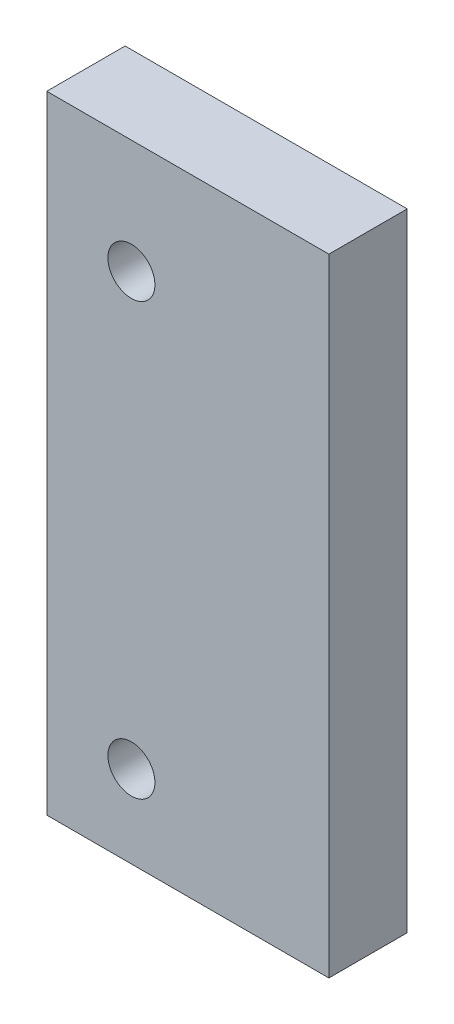
ISO-10303-21;
HEADER;
FILE_DESCRIPTION(('STEP AP214'),'2;1');
FILE_NAME('part.step','',(''),(''),'','','');
FILE_SCHEMA(('AUTOMOTIVE_DESIGN { 1 0 10303 214 1 1 1 1 }'));
ENDSEC;
DATA;
#1=APPLICATION_CONTEXT('core data for automotive mechanical design processes');
#2=APPLICATION_PROTOCOL_DEFINITION('international standard','automotive_design',2000,#1);
#3=PRODUCT_CONTEXT('',#1,'mechanical');
#4=PRODUCT('Part','Part','',(#3));
#5=PRODUCT_RELATED_PRODUCT_CATEGORY('part','',(#4));
#6=PRODUCT_DEFINITION_FORMATION('','',#4);
#7=PRODUCT_DEFINITION_CONTEXT('part definition',#1,'design');
#8=PRODUCT_DEFINITION('design','',#6,#7);
#9=PRODUCT_DEFINITION_SHAPE('','',#8);
#10=(LENGTH_UNIT() NAMED_UNIT(*) SI_UNIT(.MILLI.,.METRE.));
#11=(NAMED_UNIT(*) PLANE_ANGLE_UNIT() SI_UNIT($,.RADIAN.));
#12=(NAMED_UNIT(*) SI_UNIT($,.STERADIAN.) SOLID_ANGLE_UNIT());
#13=UNCERTAINTY_MEASURE_WITH_UNIT(LENGTH_MEASURE(1.E-05),#10,'distance_accuracy_value','');
#14=(GEOMETRIC_REPRESENTATION_CONTEXT(3) GLOBAL_UNCERTAINTY_ASSIGNED_CONTEXT((#13)) GLOBAL_UNIT_ASSIGNED_CONTEXT((#10,
#11,#12)) REPRESENTATION_CONTEXT('',''));
#15=CARTESIAN_POINT('',(0.,0.,0.));
#16=DIRECTION('',(0.,0.,1.));
#17=DIRECTION('',(1.,0.,0.));
#18=AXIS2_PLACEMENT_3D('',#15,#16,#17);
#19=CARTESIAN_POINT('',(9.,0.,2.5));
#20=DIRECTION('',(0.,1.,0.));
#21=DIRECTION('',(0.,0.,1.));
#22=AXIS2_PLACEMENT_3D('',#19,#20,#21);
#23=PLANE('',#22);
#24=DIRECTION('',(1.,0.,0.));
#25=VECTOR('',#24,1.);
#26=CARTESIAN_POINT('',(9.,0.,0.));
#27=LINE('',#26,#25);
#28=CARTESIAN_POINT('',(0.,0.,0.));
#29=VERTEX_POINT('',#28);
#30=CARTESIAN_POINT('',(9.,0.,0.));
#31=VERTEX_POINT('',#30);
#32=EDGE_CURVE('E96',#29,#31,#27,.T.);
#33=ORIENTED_EDGE('',*,*,#32,.T.);
#34=DIRECTION('',(0.,0.,-1.));
#35=VECTOR('',#34,1.);
#36=CARTESIAN_POINT('',(9.,0.,2.5));
#37=LINE('',#36,#35);
#38=CARTESIAN_POINT('',(9.,0.,2.5));
#39=VERTEX_POINT('',#38);
#40=EDGE_CURVE('E11',#39,#31,#37,.T.);
#41=ORIENTED_EDGE('',*,*,#40,.F.);
#42=DIRECTION('',(1.,0.,0.));
#43=VECTOR('',#42,1.);
#44=CARTESIAN_POINT('',(9.,0.,2.5));
#45=LINE('',#44,#43);
#46=CARTESIAN_POINT('',(0.,0.,2.5));
#47=VERTEX_POINT('',#46);
#48=EDGE_CURVE('E84',#47,#39,#45,.T.);
#49=ORIENTED_EDGE('',*,*,#48,.F.);
#50=DIRECTION('',(0.,0.,-1.));
#51=VECTOR('',#50,1.);
#52=CARTESIAN_POINT('',(0.,0.,2.5));
#53=LINE('',#52,#51);
#54=EDGE_CURVE('E92',#47,#29,#53,.T.);
#55=ORIENTED_EDGE('',*,*,#54,.T.);
#56=EDGE_LOOP('',(#33,#41,#49,#55));
#57=FACE_BOUND('',#56,.T.);
#58=ADVANCED_FACE('F33',(#57),#23,.F.);
#59=CARTESIAN_POINT('',(8.99999999999999,20.,2.5));
#60=DIRECTION('',(-1.,0.,0.));
#61=DIRECTION('',(0.,-1.,0.));
#62=AXIS2_PLACEMENT_3D('',#59,#60,#61);
#63=PLANE('',#62);
#64=DIRECTION('',(0.,1.,0.));
#65=VECTOR('',#64,1.);
#66=CARTESIAN_POINT('',(8.99999999999999,20.,0.));
#67=LINE('',#66,#65);
#68=CARTESIAN_POINT('',(8.99999999999999,20.,0.));
#69=VERTEX_POINT('',#68);
#70=EDGE_CURVE('E88',#31,#69,#67,.T.);
#71=ORIENTED_EDGE('',*,*,#70,.T.);
#72=DIRECTION('',(0.,0.,-1.));
#73=VECTOR('',#72,1.);
#74=CARTESIAN_POINT('',(8.99999999999999,20.,2.5));
#75=LINE('',#74,#73);
#76=CARTESIAN_POINT('',(8.99999999999999,20.,2.5));
#77=VERTEX_POINT('',#76);
#78=EDGE_CURVE('E41',#77,#69,#75,.T.);
#79=ORIENTED_EDGE('',*,*,#78,.F.);
#80=DIRECTION('',(0.,1.,0.));
#81=VECTOR('',#80,1.);
#82=CARTESIAN_POINT('',(8.99999999999999,20.,2.5));
#83=LINE('',#82,#81);
#84=EDGE_CURVE('E79',#39,#77,#83,.T.);
#85=ORIENTED_EDGE('',*,*,#84,.F.);
#86=ORIENTED_EDGE('',*,*,#40,.T.);
#87=EDGE_LOOP('',(#71,#79,#85,#86));
#88=FACE_BOUND('',#87,.T.);
#89=ADVANCED_FACE('F87',(#88),#63,.F.);
#90=CARTESIAN_POINT('',(0.,20.,2.5));
#91=DIRECTION('',(0.,-1.,0.));
#92=DIRECTION('',(0.,0.,-1.));
#93=AXIS2_PLACEMENT_3D('',#90,#91,#92);
#94=PLANE('',#93);
#95=DIRECTION('',(-1.,0.,0.));
#96=VECTOR('',#95,1.);
#97=CARTESIAN_POINT('',(0.,20.,0.));
#98=LINE('',#97,#96);
#99=CARTESIAN_POINT('',(0.,20.,0.));
#100=VERTEX_POINT('',#99);
#101=EDGE_CURVE('E66',#69,#100,#98,.T.);
#102=ORIENTED_EDGE('',*,*,#101,.T.);
#103=DIRECTION('',(0.,0.,-1.));
#104=VECTOR('',#103,1.);
#105=CARTESIAN_POINT('',(0.,20.,2.5));
#106=LINE('',#105,#104);
#107=CARTESIAN_POINT('',(0.,20.,2.5));
#108=VERTEX_POINT('',#107);
#109=EDGE_CURVE('E89',#108,#100,#106,.T.);
#110=ORIENTED_EDGE('',*,*,#109,.F.);
#111=DIRECTION('',(-1.,0.,0.));
#112=VECTOR('',#111,1.);
#113=CARTESIAN_POINT('',(0.,20.,2.5));
#114=LINE('',#113,#112);
#115=EDGE_CURVE('E82',#77,#108,#114,.T.);
#116=ORIENTED_EDGE('',*,*,#115,.F.);
#117=ORIENTED_EDGE('',*,*,#78,.T.);
#118=EDGE_LOOP('',(#102,#110,#116,#117));
#119=FACE_BOUND('',#118,.T.);
#120=ADVANCED_FACE('F90',(#119),#94,.F.);
#121=CARTESIAN_POINT('',(0.,0.,2.5));
#122=DIRECTION('',(1.,0.,0.));
#123=DIRECTION('',(0.,1.,0.));
#124=AXIS2_PLACEMENT_3D('',#121,#122,#123);
#125=PLANE('',#124);
#126=DIRECTION('',(0.,-1.,0.));
#127=VECTOR('',#126,1.);
#128=CARTESIAN_POINT('',(0.,0.,0.));
#129=LINE('',#128,#127);
#130=EDGE_CURVE('E72',#100,#29,#129,.T.);
#131=ORIENTED_EDGE('',*,*,#130,.T.);
#132=ORIENTED_EDGE('',*,*,#54,.F.);
#133=DIRECTION('',(0.,-1.,0.));
#134=VECTOR('',#133,1.);
#135=CARTESIAN_POINT('',(0.,0.,2.5));
#136=LINE('',#135,#134);
#137=EDGE_CURVE('E49',#108,#47,#136,.T.);
#138=ORIENTED_EDGE('',*,*,#137,.F.);
#139=ORIENTED_EDGE('',*,*,#109,.T.);
#140=EDGE_LOOP('',(#131,#132,#138,#139));
#141=FACE_BOUND('',#140,.T.);
#142=ADVANCED_FACE('F104',(#141),#125,.F.);
#143=CARTESIAN_POINT('',(0.,0.,2.5));
#144=DIRECTION('',(0.,0.,-1.));
#145=DIRECTION('',(-1.,0.,0.));
#146=AXIS2_PLACEMENT_3D('',#143,#144,#145);
#147=PLANE('',#146);
#148=CARTESIAN_POINT('',(2.69999999999999,16.375,2.5));
#149=DIRECTION('',(0.,0.,1.));
#150=DIRECTION('',(1.,0.,0.));
#151=AXIS2_PLACEMENT_3D('',#148,#149,#150);
#152=CIRCLE('',#151,0.750000000000001);
#153=CARTESIAN_POINT('',(3.45,16.375,2.5));
#154=VERTEX_POINT('',#153);
#155=EDGE_CURVE('E116',#154,#154,#152,.T.);
#156=ORIENTED_EDGE('',*,*,#155,.F.);
#157=EDGE_LOOP('',(#156));
#158=FACE_BOUND('',#157,.T.);
#159=CARTESIAN_POINT('',(2.69999999999999,2.625,2.5));
#160=DIRECTION('',(0.,0.,1.));
#161=DIRECTION('',(1.,0.,0.));
#162=AXIS2_PLACEMENT_3D('',#159,#160,#161);
#163=CIRCLE('',#162,0.750000000000001);
#164=CARTESIAN_POINT('',(3.45,2.625,2.5));
#165=VERTEX_POINT('',#164);
#166=EDGE_CURVE('E110',#165,#165,#163,.T.);
#167=ORIENTED_EDGE('',*,*,#166,.F.);
#168=EDGE_LOOP('',(#167));
#169=FACE_BOUND('',#168,.T.);
#170=ORIENTED_EDGE('',*,*,#48,.T.);
#171=ORIENTED_EDGE('',*,*,#84,.T.);
#172=ORIENTED_EDGE('',*,*,#115,.T.);
#173=ORIENTED_EDGE('',*,*,#137,.T.);
#174=EDGE_LOOP('',(#170,#171,#172,#173));
#175=FACE_BOUND('',#174,.T.);
#176=ADVANCED_FACE('F80',(#158,#169,#175),#147,.F.);
#177=CARTESIAN_POINT('',(0.,0.,0.));
#178=DIRECTION('',(0.,0.,-1.));
#179=DIRECTION('',(-1.,0.,0.));
#180=AXIS2_PLACEMENT_3D('',#177,#178,#179);
#181=PLANE('',#180);
#182=CARTESIAN_POINT('',(2.69999999999999,16.375,0.));
#183=DIRECTION('',(0.,0.,1.));
#184=DIRECTION('',(1.,0.,0.));
#185=AXIS2_PLACEMENT_3D('',#182,#183,#184);
#186=CIRCLE('',#185,0.750000000000001);
#187=CARTESIAN_POINT('',(3.45,16.375,0.));
#188=VERTEX_POINT('',#187);
#189=EDGE_CURVE('E99',#188,#188,#186,.T.);
#190=ORIENTED_EDGE('',*,*,#189,.T.);
#191=EDGE_LOOP('',(#190));
#192=FACE_BOUND('',#191,.T.);
#193=CARTESIAN_POINT('',(2.69999999999999,2.625,0.));
#194=DIRECTION('',(0.,0.,1.));
#195=DIRECTION('',(1.,0.,0.));
#196=AXIS2_PLACEMENT_3D('',#193,#194,#195);
#197=CIRCLE('',#196,0.750000000000001);
#198=CARTESIAN_POINT('',(3.45,2.625,0.));
#199=VERTEX_POINT('',#198);
#200=EDGE_CURVE('E113',#199,#199,#197,.T.);
#201=ORIENTED_EDGE('',*,*,#200,.T.);
#202=EDGE_LOOP('',(#201));
#203=FACE_BOUND('',#202,.T.);
#204=ORIENTED_EDGE('',*,*,#32,.F.);
#205=ORIENTED_EDGE('',*,*,#130,.F.);
#206=ORIENTED_EDGE('',*,*,#101,.F.);
#207=ORIENTED_EDGE('',*,*,#70,.F.);
#208=EDGE_LOOP('',(#204,#205,#206,#207));
#209=FACE_BOUND('',#208,.T.);
#210=ADVANCED_FACE('F107',(#192,#203,#209),#181,.T.);
#211=CARTESIAN_POINT('',(2.69999999999999,2.625,0.));
#212=DIRECTION('',(0.,0.,1.));
#213=DIRECTION('',(1.,0.,0.));
#214=AXIS2_PLACEMENT_3D('',#211,#212,#213);
#215=CYLINDRICAL_SURFACE('',#214,0.750000000000001);
#216=ORIENTED_EDGE('',*,*,#200,.F.);
#217=EDGE_LOOP('',(#216));
#218=FACE_BOUND('',#217,.T.);
#219=ORIENTED_EDGE('',*,*,#166,.T.);
#220=EDGE_LOOP('',(#219));
#221=FACE_BOUND('',#220,.T.);
#222=ADVANCED_FACE('F127',(#218,#221),#215,.F.);
#223=CARTESIAN_POINT('',(2.69999999999999,16.375,0.));
#224=DIRECTION('',(0.,0.,1.));
#225=DIRECTION('',(1.,0.,0.));
#226=AXIS2_PLACEMENT_3D('',#223,#224,#225);
#227=CYLINDRICAL_SURFACE('',#226,0.750000000000001);
#228=ORIENTED_EDGE('',*,*,#189,.F.);
#229=EDGE_LOOP('',(#228));
#230=FACE_BOUND('',#229,.T.);
#231=ORIENTED_EDGE('',*,*,#155,.T.);
#232=EDGE_LOOP('',(#231));
#233=FACE_BOUND('',#232,.T.);
#234=ADVANCED_FACE('F124',(#230,#233),#227,.F.);
#235=CLOSED_SHELL('',(#58,#89,#120,#142,#176,#210,#222,#234));
#236=MANIFOLD_SOLID_BREP('B2',#235);
#237=ADVANCED_BREP_SHAPE_REPRESENTATION('',(#18,#236),#14);
#238=SHAPE_DEFINITION_REPRESENTATION(#9,#237);
ENDSEC;
END-ISO-10303-21;
